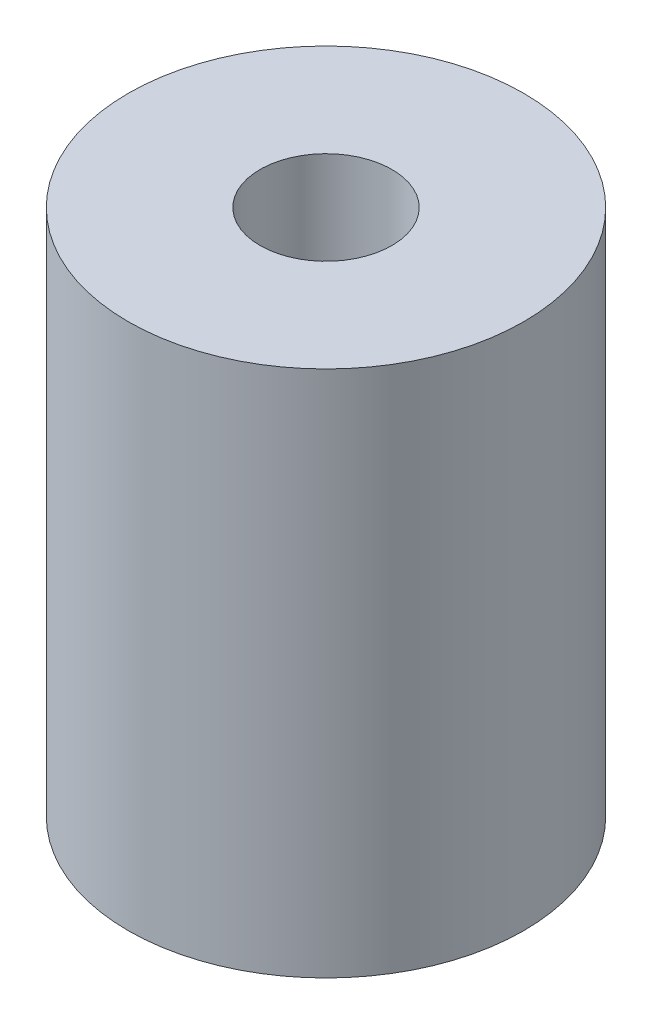
ISO-10303-21;
HEADER;
FILE_DESCRIPTION(('STEP AP214'),'2;1');
FILE_NAME('part.step','',(''),(''),'','','');
FILE_SCHEMA(('AUTOMOTIVE_DESIGN { 1 0 10303 214 1 1 1 1 }'));
ENDSEC;
DATA;
#1=APPLICATION_CONTEXT('core data for automotive mechanical design processes');
#2=APPLICATION_PROTOCOL_DEFINITION('international standard','automotive_design',2000,#1);
#3=PRODUCT_CONTEXT('',#1,'mechanical');
#4=PRODUCT('Part','Part','',(#3));
#5=PRODUCT_RELATED_PRODUCT_CATEGORY('part','',(#4));
#6=PRODUCT_DEFINITION_FORMATION('','',#4);
#7=PRODUCT_DEFINITION_CONTEXT('part definition',#1,'design');
#8=PRODUCT_DEFINITION('design','',#6,#7);
#9=PRODUCT_DEFINITION_SHAPE('','',#8);
#10=(LENGTH_UNIT() NAMED_UNIT(*) SI_UNIT(.MILLI.,.METRE.));
#11=(NAMED_UNIT(*) PLANE_ANGLE_UNIT() SI_UNIT($,.RADIAN.));
#12=(NAMED_UNIT(*) SI_UNIT($,.STERADIAN.) SOLID_ANGLE_UNIT());
#13=UNCERTAINTY_MEASURE_WITH_UNIT(LENGTH_MEASURE(1.E-05),#10,'distance_accuracy_value','');
#14=(GEOMETRIC_REPRESENTATION_CONTEXT(3) GLOBAL_UNCERTAINTY_ASSIGNED_CONTEXT((#13)) GLOBAL_UNIT_ASSIGNED_CONTEXT((#10,
#11,#12)) REPRESENTATION_CONTEXT('',''));
#15=CARTESIAN_POINT('',(0.,0.,0.));
#16=DIRECTION('',(0.,0.,1.));
#17=DIRECTION('',(1.,0.,0.));
#18=AXIS2_PLACEMENT_3D('',#15,#16,#17);
#19=CARTESIAN_POINT('',(0.,25.4,0.));
#20=DIRECTION('',(0.,1.,0.));
#21=DIRECTION('',(0.,0.,1.));
#22=AXIS2_PLACEMENT_3D('',#19,#20,#21);
#23=PLANE('',#22);
#24=CARTESIAN_POINT('',(0.,25.4,0.));
#25=DIRECTION('',(0.,1.,0.));
#26=DIRECTION('',(0.,0.,1.));
#27=AXIS2_PLACEMENT_3D('',#24,#25,#26);
#28=CIRCLE('',#27,9.525);
#29=CARTESIAN_POINT('',(0.,25.4,9.525));
#30=VERTEX_POINT('',#29);
#31=EDGE_CURVE('E10',#30,#30,#28,.T.);
#32=ORIENTED_EDGE('',*,*,#31,.T.);
#33=EDGE_LOOP('',(#32));
#34=FACE_BOUND('',#33,.T.);
#35=CARTESIAN_POINT('',(0.,25.4,0.));
#36=DIRECTION('',(0.,1.,0.));
#37=DIRECTION('',(0.,0.,1.));
#38=AXIS2_PLACEMENT_3D('',#35,#36,#37);
#39=CIRCLE('',#38,3.175);
#40=CARTESIAN_POINT('',(0.,25.4,3.175));
#41=VERTEX_POINT('',#40);
#42=EDGE_CURVE('E42',#41,#41,#39,.T.);
#43=ORIENTED_EDGE('',*,*,#42,.F.);
#44=EDGE_LOOP('',(#43));
#45=FACE_BOUND('',#44,.T.);
#46=ADVANCED_FACE('F31',(#34,#45),#23,.T.);
#47=CARTESIAN_POINT('',(0.,0.,0.));
#48=DIRECTION('',(0.,1.,0.));
#49=DIRECTION('',(0.,0.,1.));
#50=AXIS2_PLACEMENT_3D('',#47,#48,#49);
#51=PLANE('',#50);
#52=CARTESIAN_POINT('',(0.,0.,0.));
#53=DIRECTION('',(0.,1.,0.));
#54=DIRECTION('',(0.,0.,1.));
#55=AXIS2_PLACEMENT_3D('',#52,#53,#54);
#56=CIRCLE('',#55,9.525);
#57=CARTESIAN_POINT('',(0.,0.,9.525));
#58=VERTEX_POINT('',#57);
#59=EDGE_CURVE('E35',#58,#58,#56,.T.);
#60=ORIENTED_EDGE('',*,*,#59,.F.);
#61=EDGE_LOOP('',(#60));
#62=FACE_BOUND('',#61,.T.);
#63=CARTESIAN_POINT('',(0.,0.,0.));
#64=DIRECTION('',(0.,1.,0.));
#65=DIRECTION('',(0.,0.,1.));
#66=AXIS2_PLACEMENT_3D('',#63,#64,#65);
#67=CIRCLE('',#66,3.175);
#68=CARTESIAN_POINT('',(0.,0.,3.175));
#69=VERTEX_POINT('',#68);
#70=EDGE_CURVE('E44',#69,#69,#67,.T.);
#71=ORIENTED_EDGE('',*,*,#70,.T.);
#72=EDGE_LOOP('',(#71));
#73=FACE_BOUND('',#72,.T.);
#74=ADVANCED_FACE('F54',(#62,#73),#51,.F.);
#75=CARTESIAN_POINT('',(0.,25.4,0.));
#76=DIRECTION('',(0.,-1.,0.));
#77=DIRECTION('',(0.,0.,-1.));
#78=AXIS2_PLACEMENT_3D('',#75,#76,#77);
#79=CYLINDRICAL_SURFACE('',#78,9.525);
#80=ORIENTED_EDGE('',*,*,#31,.F.);
#81=EDGE_LOOP('',(#80));
#82=FACE_BOUND('',#81,.T.);
#83=ORIENTED_EDGE('',*,*,#59,.T.);
#84=EDGE_LOOP('',(#83));
#85=FACE_BOUND('',#84,.T.);
#86=ADVANCED_FACE('F33',(#82,#85),#79,.T.);
#87=CARTESIAN_POINT('',(0.,25.4,0.));
#88=DIRECTION('',(0.,-1.,0.));
#89=DIRECTION('',(0.,0.,-1.));
#90=AXIS2_PLACEMENT_3D('',#87,#88,#89);
#91=CYLINDRICAL_SURFACE('',#90,3.175);
#92=ORIENTED_EDGE('',*,*,#42,.T.);
#93=EDGE_LOOP('',(#92));
#94=FACE_BOUND('',#93,.T.);
#95=ORIENTED_EDGE('',*,*,#70,.F.);
#96=EDGE_LOOP('',(#95));
#97=FACE_BOUND('',#96,.T.);
#98=ADVANCED_FACE('F50',(#94,#97),#91,.F.);
#99=CLOSED_SHELL('',(#46,#74,#86,#98));
#100=MANIFOLD_SOLID_BREP('B2',#99);
#101=ADVANCED_BREP_SHAPE_REPRESENTATION('',(#18,#100),#14);
#102=SHAPE_DEFINITION_REPRESENTATION(#9,#101);
ENDSEC;
END-ISO-10303-21;
